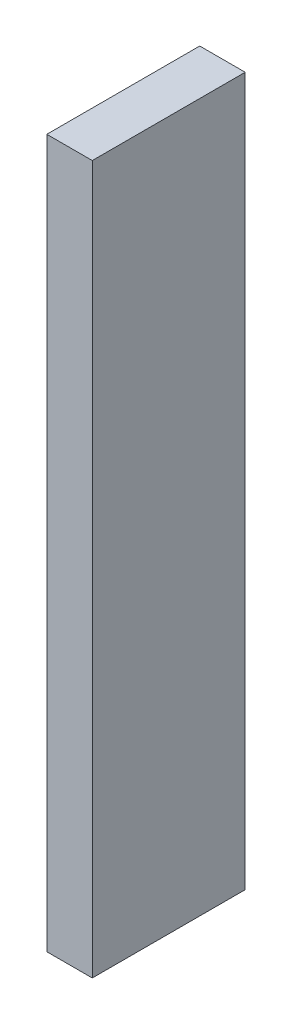
ISO-10303-21;
HEADER;
FILE_DESCRIPTION(('STEP AP214'),'2;1');
FILE_NAME('part.step','',(''),(''),'','','');
FILE_SCHEMA(('AUTOMOTIVE_DESIGN { 1 0 10303 214 1 1 1 1 }'));
ENDSEC;
DATA;
#1=APPLICATION_CONTEXT('core data for automotive mechanical design processes');
#2=APPLICATION_PROTOCOL_DEFINITION('international standard','automotive_design',2000,#1);
#3=PRODUCT_CONTEXT('',#1,'mechanical');
#4=PRODUCT('Part','Part','',(#3));
#5=PRODUCT_RELATED_PRODUCT_CATEGORY('part','',(#4));
#6=PRODUCT_DEFINITION_FORMATION('','',#4);
#7=PRODUCT_DEFINITION_CONTEXT('part definition',#1,'design');
#8=PRODUCT_DEFINITION('design','',#6,#7);
#9=PRODUCT_DEFINITION_SHAPE('','',#8);
#10=(LENGTH_UNIT() NAMED_UNIT(*) SI_UNIT(.MILLI.,.METRE.));
#11=(NAMED_UNIT(*) PLANE_ANGLE_UNIT() SI_UNIT($,.RADIAN.));
#12=(NAMED_UNIT(*) SI_UNIT($,.STERADIAN.) SOLID_ANGLE_UNIT());
#13=UNCERTAINTY_MEASURE_WITH_UNIT(LENGTH_MEASURE(1.E-05),#10,'distance_accuracy_value','');
#14=(GEOMETRIC_REPRESENTATION_CONTEXT(3) GLOBAL_UNCERTAINTY_ASSIGNED_CONTEXT((#13)) GLOBAL_UNIT_ASSIGNED_CONTEXT((#10,
#11,#12)) REPRESENTATION_CONTEXT('',''));
#15=CARTESIAN_POINT('',(0.,0.,0.));
#16=DIRECTION('',(0.,0.,1.));
#17=DIRECTION('',(1.,0.,0.));
#18=AXIS2_PLACEMENT_3D('',#15,#16,#17);
#19=CARTESIAN_POINT('',(130.275545237866,22.4180708263693,71.0720244776067));
#20=DIRECTION('',(-1.69244514382854E-09,0.,1.));
#21=DIRECTION('',(1.,0.,1.69244514382854E-09));
#22=AXIS2_PLACEMENT_3D('',#19,#20,#21);
#23=PLANE('',#22);
#24=DIRECTION('',(0.,-1.,0.));
#25=VECTOR('',#24,1.);
#26=CARTESIAN_POINT('',(131.258630334879,22.4180708263693,71.0720244792706));
#27=LINE('',#26,#25);
#28=CARTESIAN_POINT('',(131.258630334879,22.4180708263693,71.0720244792706));
#29=VERTEX_POINT('',#28);
#30=CARTESIAN_POINT('',(131.258630334879,7.11212965552236,71.0720244792706));
#31=VERTEX_POINT('',#30);
#32=EDGE_CURVE('E79',#29,#31,#27,.T.);
#33=ORIENTED_EDGE('',*,*,#32,.F.);
#34=DIRECTION('',(1.,0.,1.69244514382854E-09));
#35=VECTOR('',#34,1.);
#36=CARTESIAN_POINT('',(130.275545237866,22.4180708263693,71.0720244776067));
#37=LINE('',#36,#35);
#38=CARTESIAN_POINT('',(130.275545237866,22.4180708263693,71.0720244776067));
#39=VERTEX_POINT('',#38);
#40=EDGE_CURVE('E32',#39,#29,#37,.T.);
#41=ORIENTED_EDGE('',*,*,#40,.F.);
#42=DIRECTION('',(0.,-1.,0.));
#43=VECTOR('',#42,1.);
#44=CARTESIAN_POINT('',(130.275545237866,22.4180708263693,71.0720244776067));
#45=LINE('',#44,#43);
#46=CARTESIAN_POINT('',(130.275545237866,7.11212965552236,71.0720244776067));
#47=VERTEX_POINT('',#46);
#48=EDGE_CURVE('E71',#39,#47,#45,.T.);
#49=ORIENTED_EDGE('',*,*,#48,.T.);
#50=DIRECTION('',(1.,0.,1.69244514382854E-09));
#51=VECTOR('',#50,1.);
#52=CARTESIAN_POINT('',(130.275545237866,7.11212965552236,71.0720244776067));
#53=LINE('',#52,#51);
#54=EDGE_CURVE('E10',#47,#31,#53,.T.);
#55=ORIENTED_EDGE('',*,*,#54,.T.);
#56=EDGE_LOOP('',(#33,#41,#49,#55));
#57=FACE_BOUND('',#56,.T.);
#58=ADVANCED_FACE('F16',(#57),#23,.T.);
#59=CARTESIAN_POINT('',(130.275545237866,7.11212965552236,71.0720244776067));
#60=DIRECTION('',(0.,-1.,0.));
#61=DIRECTION('',(0.,0.,-1.));
#62=AXIS2_PLACEMENT_3D('',#59,#60,#61);
#63=PLANE('',#62);
#64=DIRECTION('',(1.69244514382854E-09,0.,-1.));
#65=VECTOR('',#64,1.);
#66=CARTESIAN_POINT('',(131.258630334879,7.11212965552236,71.0720244792706));
#67=LINE('',#66,#65);
#68=CARTESIAN_POINT('',(131.258630340474,7.11212965552235,67.7660833084218));
#69=VERTEX_POINT('',#68);
#70=EDGE_CURVE('E82',#31,#69,#67,.T.);
#71=ORIENTED_EDGE('',*,*,#70,.F.);
#72=ORIENTED_EDGE('',*,*,#54,.F.);
#73=DIRECTION('',(1.69244514382854E-09,0.,-1.));
#74=VECTOR('',#73,1.);
#75=CARTESIAN_POINT('',(130.275545237866,7.11212965552236,71.0720244776067));
#76=LINE('',#75,#74);
#77=CARTESIAN_POINT('',(130.275545243461,7.11212965552235,67.766083306758));
#78=VERTEX_POINT('',#77);
#79=EDGE_CURVE('E67',#47,#78,#76,.T.);
#80=ORIENTED_EDGE('',*,*,#79,.T.);
#81=DIRECTION('',(1.,0.,1.69244514382854E-09));
#82=VECTOR('',#81,1.);
#83=CARTESIAN_POINT('',(130.275545243461,7.11212965552235,67.766083306758));
#84=LINE('',#83,#82);
#85=EDGE_CURVE('E24',#78,#69,#84,.T.);
#86=ORIENTED_EDGE('',*,*,#85,.T.);
#87=EDGE_LOOP('',(#71,#72,#80,#86));
#88=FACE_BOUND('',#87,.T.);
#89=ADVANCED_FACE('F68',(#88),#63,.T.);
#90=CARTESIAN_POINT('',(130.275545243461,7.11212965552235,67.766083306758));
#91=DIRECTION('',(1.69244514382854E-09,0.,-1.));
#92=DIRECTION('',(-1.,0.,-1.69244514382854E-09));
#93=AXIS2_PLACEMENT_3D('',#90,#91,#92);
#94=PLANE('',#93);
#95=DIRECTION('',(0.,1.,0.));
#96=VECTOR('',#95,1.);
#97=CARTESIAN_POINT('',(131.258630340474,7.11212965552235,67.7660833084218));
#98=LINE('',#97,#96);
#99=CARTESIAN_POINT('',(131.258630340474,22.418070826371,67.7660832999613));
#100=VERTEX_POINT('',#99);
#101=EDGE_CURVE('E65',#69,#100,#98,.T.);
#102=ORIENTED_EDGE('',*,*,#101,.F.);
#103=ORIENTED_EDGE('',*,*,#85,.F.);
#104=DIRECTION('',(0.,1.,0.));
#105=VECTOR('',#104,1.);
#106=CARTESIAN_POINT('',(130.275545243461,7.11212965552235,67.766083306758));
#107=LINE('',#106,#105);
#108=CARTESIAN_POINT('',(130.275545243461,22.418070826371,67.7660832982974));
#109=VERTEX_POINT('',#108);
#110=EDGE_CURVE('E62',#78,#109,#107,.T.);
#111=ORIENTED_EDGE('',*,*,#110,.T.);
#112=DIRECTION('',(1.,0.,1.69244514382854E-09));
#113=VECTOR('',#112,1.);
#114=CARTESIAN_POINT('',(130.275545243461,22.418070826371,67.7660832982974));
#115=LINE('',#114,#113);
#116=EDGE_CURVE('E48',#109,#100,#115,.T.);
#117=ORIENTED_EDGE('',*,*,#116,.T.);
#118=EDGE_LOOP('',(#102,#103,#111,#117));
#119=FACE_BOUND('',#118,.T.);
#120=ADVANCED_FACE('F60',(#119),#94,.T.);
#121=CARTESIAN_POINT('',(130.275545243461,22.418070826371,67.7660832982974));
#122=DIRECTION('',(0.,1.,0.));
#123=DIRECTION('',(-1.,0.,0.));
#124=AXIS2_PLACEMENT_3D('',#121,#122,#123);
#125=PLANE('',#124);
#126=DIRECTION('',(-1.69244514382854E-09,0.,1.));
#127=VECTOR('',#126,1.);
#128=CARTESIAN_POINT('',(131.258630340474,22.418070826371,67.7660832999613));
#129=LINE('',#128,#127);
#130=EDGE_CURVE('E85',#100,#29,#129,.T.);
#131=ORIENTED_EDGE('',*,*,#130,.F.);
#132=ORIENTED_EDGE('',*,*,#116,.F.);
#133=DIRECTION('',(-1.69244514382854E-09,0.,1.));
#134=VECTOR('',#133,1.);
#135=CARTESIAN_POINT('',(130.275545243461,22.418070826371,67.7660832982974));
#136=LINE('',#135,#134);
#137=EDGE_CURVE('E74',#109,#39,#136,.T.);
#138=ORIENTED_EDGE('',*,*,#137,.T.);
#139=ORIENTED_EDGE('',*,*,#40,.T.);
#140=EDGE_LOOP('',(#131,#132,#138,#139));
#141=FACE_BOUND('',#140,.T.);
#142=ADVANCED_FACE('F96',(#141),#125,.T.);
#143=CARTESIAN_POINT('',(130.275545201028,17.2651002409467,92.8378607087388));
#144=DIRECTION('',(1.,0.,1.69244514382854E-09));
#145=DIRECTION('',(0.,1.,0.));
#146=AXIS2_PLACEMENT_3D('',#143,#144,#145);
#147=PLANE('',#146);
#148=ORIENTED_EDGE('',*,*,#48,.F.);
#149=ORIENTED_EDGE('',*,*,#137,.F.);
#150=ORIENTED_EDGE('',*,*,#110,.F.);
#151=ORIENTED_EDGE('',*,*,#79,.F.);
#152=EDGE_LOOP('',(#148,#149,#150,#151));
#153=FACE_BOUND('',#152,.T.);
#154=ADVANCED_FACE('F73',(#153),#147,.F.);
#155=CARTESIAN_POINT('',(131.258630298041,17.2651002409467,92.8378607104026));
#156=DIRECTION('',(1.,0.,1.69244514382854E-09));
#157=DIRECTION('',(0.,1.,0.));
#158=AXIS2_PLACEMENT_3D('',#155,#156,#157);
#159=PLANE('',#158);
#160=ORIENTED_EDGE('',*,*,#32,.T.);
#161=ORIENTED_EDGE('',*,*,#70,.T.);
#162=ORIENTED_EDGE('',*,*,#101,.T.);
#163=ORIENTED_EDGE('',*,*,#130,.T.);
#164=EDGE_LOOP('',(#160,#161,#162,#163));
#165=FACE_BOUND('',#164,.T.);
#166=ADVANCED_FACE('F89',(#165),#159,.T.);
#167=CLOSED_SHELL('',(#58,#89,#120,#142,#154,#166));
#168=MANIFOLD_SOLID_BREP('B1',#167);
#169=ADVANCED_BREP_SHAPE_REPRESENTATION('',(#18,#168),#14);
#170=SHAPE_DEFINITION_REPRESENTATION(#9,#169);
ENDSEC;
END-ISO-10303-21;
